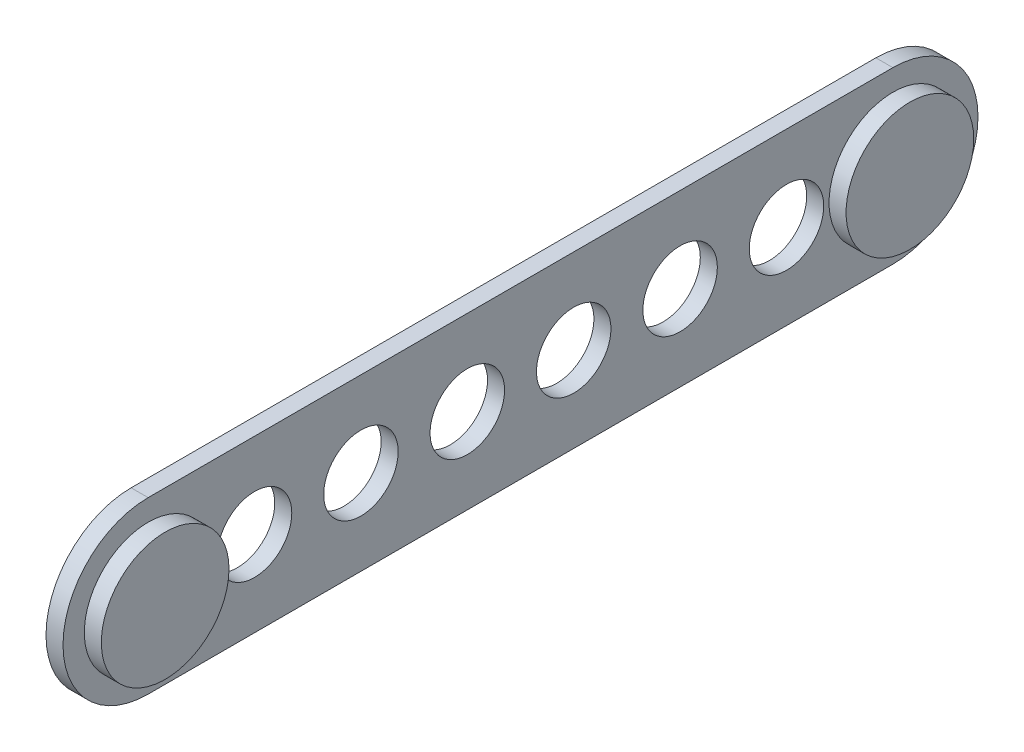
ISO-10303-21;
HEADER;
FILE_DESCRIPTION(('STEP AP214'),'2;1');
FILE_NAME('part.step','',(''),(''),'','','');
FILE_SCHEMA(('AUTOMOTIVE_DESIGN { 1 0 10303 214 1 1 1 1 }'));
ENDSEC;
DATA;
#1=APPLICATION_CONTEXT('core data for automotive mechanical design processes');
#2=APPLICATION_PROTOCOL_DEFINITION('international standard','automotive_design',2000,#1);
#3=PRODUCT_CONTEXT('',#1,'mechanical');
#4=PRODUCT('Part','Part','',(#3));
#5=PRODUCT_RELATED_PRODUCT_CATEGORY('part','',(#4));
#6=PRODUCT_DEFINITION_FORMATION('','',#4);
#7=PRODUCT_DEFINITION_CONTEXT('part definition',#1,'design');
#8=PRODUCT_DEFINITION('design','',#6,#7);
#9=PRODUCT_DEFINITION_SHAPE('','',#8);
#10=(LENGTH_UNIT() NAMED_UNIT(*) SI_UNIT(.MILLI.,.METRE.));
#11=(NAMED_UNIT(*) PLANE_ANGLE_UNIT() SI_UNIT($,.RADIAN.));
#12=(NAMED_UNIT(*) SI_UNIT($,.STERADIAN.) SOLID_ANGLE_UNIT());
#13=UNCERTAINTY_MEASURE_WITH_UNIT(LENGTH_MEASURE(1.E-05),#10,'distance_accuracy_value','');
#14=(GEOMETRIC_REPRESENTATION_CONTEXT(3) GLOBAL_UNCERTAINTY_ASSIGNED_CONTEXT((#13)) GLOBAL_UNIT_ASSIGNED_CONTEXT((#10,
#11,#12)) REPRESENTATION_CONTEXT('',''));
#15=CARTESIAN_POINT('',(0.,0.,0.));
#16=DIRECTION('',(0.,0.,1.));
#17=DIRECTION('',(1.,0.,0.));
#18=AXIS2_PLACEMENT_3D('',#15,#16,#17);
#19=CARTESIAN_POINT('',(4.064,0.,0.));
#20=DIRECTION('',(-1.,0.,0.));
#21=DIRECTION('',(0.,0.,1.));
#22=AXIS2_PLACEMENT_3D('',#19,#20,#21);
#23=CYLINDRICAL_SURFACE('',#22,20.32);
#24=CARTESIAN_POINT('',(0.,0.,0.));
#25=DIRECTION('',(1.,0.,0.));
#26=DIRECTION('',(0.,0.,-1.));
#27=AXIS2_PLACEMENT_3D('',#24,#25,#26);
#28=CIRCLE('',#27,20.32);
#29=CARTESIAN_POINT('',(0.,20.32,0.));
#30=VERTEX_POINT('',#29);
#31=CARTESIAN_POINT('',(0.,-20.32,0.));
#32=VERTEX_POINT('',#31);
#33=EDGE_CURVE('E102',#30,#32,#28,.T.);
#34=ORIENTED_EDGE('',*,*,#33,.T.);
#35=DIRECTION('',(-1.,0.,0.));
#36=VECTOR('',#35,1.);
#37=CARTESIAN_POINT('',(4.064,-20.32,0.));
#38=LINE('',#37,#36);
#39=CARTESIAN_POINT('',(4.064,-20.32,0.));
#40=VERTEX_POINT('',#39);
#41=EDGE_CURVE('E93',#40,#32,#38,.T.);
#42=ORIENTED_EDGE('',*,*,#41,.F.);
#43=CARTESIAN_POINT('',(4.064,0.,0.));
#44=DIRECTION('',(1.,0.,0.));
#45=DIRECTION('',(0.,0.,-1.));
#46=AXIS2_PLACEMENT_3D('',#43,#44,#45);
#47=CIRCLE('',#46,20.32);
#48=CARTESIAN_POINT('',(4.064,20.32,0.));
#49=VERTEX_POINT('',#48);
#50=EDGE_CURVE('E87',#49,#40,#47,.T.);
#51=ORIENTED_EDGE('',*,*,#50,.F.);
#52=DIRECTION('',(-1.,0.,0.));
#53=VECTOR('',#52,1.);
#54=CARTESIAN_POINT('',(4.064,20.32,0.));
#55=LINE('',#54,#53);
#56=EDGE_CURVE('E98',#49,#30,#55,.T.);
#57=ORIENTED_EDGE('',*,*,#56,.T.);
#58=EDGE_LOOP('',(#34,#42,#51,#57));
#59=FACE_BOUND('',#58,.T.);
#60=ADVANCED_FACE('F33',(#59),#23,.T.);
#61=CARTESIAN_POINT('',(4.064,-20.32,0.));
#62=DIRECTION('',(0.,1.,0.));
#63=DIRECTION('',(0.,0.,1.));
#64=AXIS2_PLACEMENT_3D('',#61,#62,#63);
#65=PLANE('',#64);
#66=DIRECTION('',(0.,0.,-1.));
#67=VECTOR('',#66,1.);
#68=CARTESIAN_POINT('',(0.,-20.32,0.));
#69=LINE('',#68,#67);
#70=CARTESIAN_POINT('',(0.,-20.32,-177.8));
#71=VERTEX_POINT('',#70);
#72=EDGE_CURVE('E92',#32,#71,#69,.T.);
#73=ORIENTED_EDGE('',*,*,#72,.T.);
#74=DIRECTION('',(-1.,0.,0.));
#75=VECTOR('',#74,1.);
#76=CARTESIAN_POINT('',(4.064,-20.32,-177.8));
#77=LINE('',#76,#75);
#78=CARTESIAN_POINT('',(4.064,-20.32,-177.8));
#79=VERTEX_POINT('',#78);
#80=EDGE_CURVE('E90',#79,#71,#77,.T.);
#81=ORIENTED_EDGE('',*,*,#80,.F.);
#82=DIRECTION('',(0.,0.,-1.));
#83=VECTOR('',#82,1.);
#84=CARTESIAN_POINT('',(4.064,-20.32,0.));
#85=LINE('',#84,#83);
#86=EDGE_CURVE('E81',#40,#79,#85,.T.);
#87=ORIENTED_EDGE('',*,*,#86,.F.);
#88=ORIENTED_EDGE('',*,*,#41,.T.);
#89=EDGE_LOOP('',(#73,#81,#87,#88));
#90=FACE_BOUND('',#89,.T.);
#91=ADVANCED_FACE('F91',(#90),#65,.F.);
#92=CARTESIAN_POINT('',(4.064,0.,-177.8));
#93=DIRECTION('',(-1.,0.,0.));
#94=DIRECTION('',(0.,0.,1.));
#95=AXIS2_PLACEMENT_3D('',#92,#93,#94);
#96=CYLINDRICAL_SURFACE('',#95,20.32);
#97=CARTESIAN_POINT('',(0.,0.,-177.8));
#98=DIRECTION('',(1.,0.,0.));
#99=DIRECTION('',(0.,0.,-1.));
#100=AXIS2_PLACEMENT_3D('',#97,#98,#99);
#101=CIRCLE('',#100,20.32);
#102=CARTESIAN_POINT('',(0.,20.32,-177.8));
#103=VERTEX_POINT('',#102);
#104=EDGE_CURVE('E67',#71,#103,#101,.T.);
#105=ORIENTED_EDGE('',*,*,#104,.T.);
#106=DIRECTION('',(-1.,0.,0.));
#107=VECTOR('',#106,1.);
#108=CARTESIAN_POINT('',(4.064,20.32,-177.8));
#109=LINE('',#108,#107);
#110=CARTESIAN_POINT('',(4.064,20.32,-177.8));
#111=VERTEX_POINT('',#110);
#112=EDGE_CURVE('E94',#111,#103,#109,.T.);
#113=ORIENTED_EDGE('',*,*,#112,.F.);
#114=CARTESIAN_POINT('',(4.064,0.,-177.8));
#115=DIRECTION('',(1.,0.,0.));
#116=DIRECTION('',(0.,0.,-1.));
#117=AXIS2_PLACEMENT_3D('',#114,#115,#116);
#118=CIRCLE('',#117,20.32);
#119=EDGE_CURVE('E85',#79,#111,#118,.T.);
#120=ORIENTED_EDGE('',*,*,#119,.F.);
#121=ORIENTED_EDGE('',*,*,#80,.T.);
#122=EDGE_LOOP('',(#105,#113,#120,#121));
#123=FACE_BOUND('',#122,.T.);
#124=ADVANCED_FACE('F96',(#123),#96,.T.);
#125=CARTESIAN_POINT('',(4.064,20.32,0.));
#126=DIRECTION('',(0.,-1.,0.));
#127=DIRECTION('',(0.,0.,-1.));
#128=AXIS2_PLACEMENT_3D('',#125,#126,#127);
#129=PLANE('',#128);
#130=DIRECTION('',(0.,0.,1.));
#131=VECTOR('',#130,1.);
#132=CARTESIAN_POINT('',(0.,20.32,0.));
#133=LINE('',#132,#131);
#134=EDGE_CURVE('E73',#103,#30,#133,.T.);
#135=ORIENTED_EDGE('',*,*,#134,.T.);
#136=ORIENTED_EDGE('',*,*,#56,.F.);
#137=DIRECTION('',(0.,0.,1.));
#138=VECTOR('',#137,1.);
#139=CARTESIAN_POINT('',(4.064,20.32,0.));
#140=LINE('',#139,#138);
#141=EDGE_CURVE('E50',#111,#49,#140,.T.);
#142=ORIENTED_EDGE('',*,*,#141,.F.);
#143=ORIENTED_EDGE('',*,*,#112,.T.);
#144=EDGE_LOOP('',(#135,#136,#142,#143));
#145=FACE_BOUND('',#144,.T.);
#146=ADVANCED_FACE('F140',(#145),#129,.F.);
#147=CARTESIAN_POINT('',(4.064,0.,0.));
#148=DIRECTION('',(1.,0.,0.));
#149=DIRECTION('',(0.,0.,-1.));
#150=AXIS2_PLACEMENT_3D('',#147,#148,#149);
#151=PLANE('',#150);
#152=CARTESIAN_POINT('',(4.064,0.,-50.8));
#153=DIRECTION('',(1.,0.,0.));
#154=DIRECTION('',(0.,0.,-1.));
#155=AXIS2_PLACEMENT_3D('',#152,#153,#154);
#156=CIRCLE('',#155,8.88999999999999);
#157=CARTESIAN_POINT('',(4.064,0.,-59.69));
#158=VERTEX_POINT('',#157);
#159=EDGE_CURVE('E312',#158,#158,#156,.T.);
#160=ORIENTED_EDGE('',*,*,#159,.F.);
#161=EDGE_LOOP('',(#160));
#162=FACE_BOUND('',#161,.T.);
#163=CARTESIAN_POINT('',(4.064,0.,-25.4));
#164=DIRECTION('',(1.,0.,0.));
#165=DIRECTION('',(0.,0.,-1.));
#166=AXIS2_PLACEMENT_3D('',#163,#164,#165);
#167=CIRCLE('',#166,8.88999999999999);
#168=CARTESIAN_POINT('',(4.064,0.,-34.29));
#169=VERTEX_POINT('',#168);
#170=EDGE_CURVE('E309',#169,#169,#167,.T.);
#171=ORIENTED_EDGE('',*,*,#170,.F.);
#172=EDGE_LOOP('',(#171));
#173=FACE_BOUND('',#172,.T.);
#174=CARTESIAN_POINT('',(4.064,0.,-177.8));
#175=DIRECTION('',(1.,0.,0.));
#176=DIRECTION('',(0.,0.,-1.));
#177=AXIS2_PLACEMENT_3D('',#174,#175,#176);
#178=CIRCLE('',#177,15.24);
#179=CARTESIAN_POINT('',(4.064,0.,-193.04));
#180=VERTEX_POINT('',#179);
#181=EDGE_CURVE('E303',#180,#180,#178,.T.);
#182=ORIENTED_EDGE('',*,*,#181,.F.);
#183=EDGE_LOOP('',(#182));
#184=FACE_BOUND('',#183,.T.);
#185=CARTESIAN_POINT('',(4.064,0.,0.));
#186=DIRECTION('',(1.,0.,0.));
#187=DIRECTION('',(0.,0.,-1.));
#188=AXIS2_PLACEMENT_3D('',#185,#186,#187);
#189=CIRCLE('',#188,15.24);
#190=CARTESIAN_POINT('',(4.064,0.,-15.24));
#191=VERTEX_POINT('',#190);
#192=EDGE_CURVE('E297',#191,#191,#189,.T.);
#193=ORIENTED_EDGE('',*,*,#192,.F.);
#194=EDGE_LOOP('',(#193));
#195=FACE_BOUND('',#194,.T.);
#196=ORIENTED_EDGE('',*,*,#50,.T.);
#197=ORIENTED_EDGE('',*,*,#86,.T.);
#198=ORIENTED_EDGE('',*,*,#119,.T.);
#199=ORIENTED_EDGE('',*,*,#141,.T.);
#200=EDGE_LOOP('',(#196,#197,#198,#199));
#201=FACE_BOUND('',#200,.T.);
#202=CARTESIAN_POINT('',(4.064,0.,-76.2));
#203=DIRECTION('',(1.,0.,0.));
#204=DIRECTION('',(0.,0.,-1.));
#205=AXIS2_PLACEMENT_3D('',#202,#203,#204);
#206=CIRCLE('',#205,8.88999999999999);
#207=CARTESIAN_POINT('',(4.064,0.,-85.09));
#208=VERTEX_POINT('',#207);
#209=EDGE_CURVE('E115',#208,#208,#206,.T.);
#210=ORIENTED_EDGE('',*,*,#209,.F.);
#211=EDGE_LOOP('',(#210));
#212=FACE_BOUND('',#211,.T.);
#213=CARTESIAN_POINT('',(4.064,0.,-101.6));
#214=DIRECTION('',(1.,0.,0.));
#215=DIRECTION('',(0.,0.,-1.));
#216=AXIS2_PLACEMENT_3D('',#213,#214,#215);
#217=CIRCLE('',#216,8.88999999999999);
#218=CARTESIAN_POINT('',(4.064,0.,-110.49));
#219=VERTEX_POINT('',#218);
#220=EDGE_CURVE('E121',#219,#219,#217,.T.);
#221=ORIENTED_EDGE('',*,*,#220,.F.);
#222=EDGE_LOOP('',(#221));
#223=FACE_BOUND('',#222,.T.);
#224=CARTESIAN_POINT('',(4.064,0.,-127.));
#225=DIRECTION('',(1.,0.,0.));
#226=DIRECTION('',(0.,0.,-1.));
#227=AXIS2_PLACEMENT_3D('',#224,#225,#226);
#228=CIRCLE('',#227,8.88999999999999);
#229=CARTESIAN_POINT('',(4.064,0.,-135.89));
#230=VERTEX_POINT('',#229);
#231=EDGE_CURVE('E127',#230,#230,#228,.T.);
#232=ORIENTED_EDGE('',*,*,#231,.F.);
#233=EDGE_LOOP('',(#232));
#234=FACE_BOUND('',#233,.T.);
#235=CARTESIAN_POINT('',(4.064,0.,-152.4));
#236=DIRECTION('',(1.,0.,0.));
#237=DIRECTION('',(0.,0.,-1.));
#238=AXIS2_PLACEMENT_3D('',#235,#236,#237);
#239=CIRCLE('',#238,8.88999999999999);
#240=CARTESIAN_POINT('',(4.064,0.,-161.29));
#241=VERTEX_POINT('',#240);
#242=EDGE_CURVE('E11',#241,#241,#239,.T.);
#243=ORIENTED_EDGE('',*,*,#242,.F.);
#244=EDGE_LOOP('',(#243));
#245=FACE_BOUND('',#244,.T.);
#246=ADVANCED_FACE('F82',(#162,#173,#184,#195,#201,#212,#223,#234,#245),#151,.T.);
#247=CARTESIAN_POINT('',(0.,0.,0.));
#248=DIRECTION('',(1.,0.,0.));
#249=DIRECTION('',(0.,0.,-1.));
#250=AXIS2_PLACEMENT_3D('',#247,#248,#249);
#251=PLANE('',#250);
#252=CARTESIAN_POINT('',(0.,0.,-50.8));
#253=DIRECTION('',(1.,0.,0.));
#254=DIRECTION('',(0.,0.,-1.));
#255=AXIS2_PLACEMENT_3D('',#252,#253,#254);
#256=CIRCLE('',#255,8.88999999999999);
#257=CARTESIAN_POINT('',(0.,0.,-59.69));
#258=VERTEX_POINT('',#257);
#259=EDGE_CURVE('E317',#258,#258,#256,.T.);
#260=ORIENTED_EDGE('',*,*,#259,.T.);
#261=EDGE_LOOP('',(#260));
#262=FACE_BOUND('',#261,.T.);
#263=CARTESIAN_POINT('',(0.,0.,-25.4));
#264=DIRECTION('',(1.,0.,0.));
#265=DIRECTION('',(0.,0.,-1.));
#266=AXIS2_PLACEMENT_3D('',#263,#264,#265);
#267=CIRCLE('',#266,8.88999999999999);
#268=CARTESIAN_POINT('',(0.,0.,-34.29));
#269=VERTEX_POINT('',#268);
#270=EDGE_CURVE('E307',#269,#269,#267,.T.);
#271=ORIENTED_EDGE('',*,*,#270,.T.);
#272=EDGE_LOOP('',(#271));
#273=FACE_BOUND('',#272,.T.);
#274=ORIENTED_EDGE('',*,*,#33,.F.);
#275=ORIENTED_EDGE('',*,*,#134,.F.);
#276=ORIENTED_EDGE('',*,*,#104,.F.);
#277=ORIENTED_EDGE('',*,*,#72,.F.);
#278=EDGE_LOOP('',(#274,#275,#276,#277));
#279=FACE_BOUND('',#278,.T.);
#280=CARTESIAN_POINT('',(0.,0.,-76.2));
#281=DIRECTION('',(1.,0.,0.));
#282=DIRECTION('',(0.,0.,-1.));
#283=AXIS2_PLACEMENT_3D('',#280,#281,#282);
#284=CIRCLE('',#283,8.88999999999999);
#285=CARTESIAN_POINT('',(0.,0.,-85.09));
#286=VERTEX_POINT('',#285);
#287=EDGE_CURVE('E112',#286,#286,#284,.T.);
#288=ORIENTED_EDGE('',*,*,#287,.T.);
#289=EDGE_LOOP('',(#288));
#290=FACE_BOUND('',#289,.T.);
#291=CARTESIAN_POINT('',(0.,0.,-101.6));
#292=DIRECTION('',(1.,0.,0.));
#293=DIRECTION('',(0.,0.,-1.));
#294=AXIS2_PLACEMENT_3D('',#291,#292,#293);
#295=CIRCLE('',#294,8.88999999999999);
#296=CARTESIAN_POINT('',(0.,0.,-110.49));
#297=VERTEX_POINT('',#296);
#298=EDGE_CURVE('E118',#297,#297,#295,.T.);
#299=ORIENTED_EDGE('',*,*,#298,.T.);
#300=EDGE_LOOP('',(#299));
#301=FACE_BOUND('',#300,.T.);
#302=CARTESIAN_POINT('',(0.,0.,-127.));
#303=DIRECTION('',(1.,0.,0.));
#304=DIRECTION('',(0.,0.,-1.));
#305=AXIS2_PLACEMENT_3D('',#302,#303,#304);
#306=CIRCLE('',#305,8.88999999999999);
#307=CARTESIAN_POINT('',(0.,0.,-135.89));
#308=VERTEX_POINT('',#307);
#309=EDGE_CURVE('E124',#308,#308,#306,.T.);
#310=ORIENTED_EDGE('',*,*,#309,.T.);
#311=EDGE_LOOP('',(#310));
#312=FACE_BOUND('',#311,.T.);
#313=CARTESIAN_POINT('',(0.,0.,-152.4));
#314=DIRECTION('',(1.,0.,0.));
#315=DIRECTION('',(0.,0.,-1.));
#316=AXIS2_PLACEMENT_3D('',#313,#314,#315);
#317=CIRCLE('',#316,8.88999999999999);
#318=CARTESIAN_POINT('',(0.,0.,-161.29));
#319=VERTEX_POINT('',#318);
#320=EDGE_CURVE('E42',#319,#319,#317,.T.);
#321=ORIENTED_EDGE('',*,*,#320,.T.);
#322=EDGE_LOOP('',(#321));
#323=FACE_BOUND('',#322,.T.);
#324=ADVANCED_FACE('F132',(#262,#273,#279,#290,#301,#312,#323),#251,.F.);
#325=CARTESIAN_POINT('',(8.128,0.,0.));
#326=DIRECTION('',(-1.,0.,0.));
#327=DIRECTION('',(0.,0.,1.));
#328=AXIS2_PLACEMENT_3D('',#325,#326,#327);
#329=CYLINDRICAL_SURFACE('',#328,15.24);
#330=CARTESIAN_POINT('',(8.128,0.,0.));
#331=DIRECTION('',(1.,0.,0.));
#332=DIRECTION('',(0.,0.,-1.));
#333=AXIS2_PLACEMENT_3D('',#330,#331,#332);
#334=CIRCLE('',#333,15.24);
#335=CARTESIAN_POINT('',(8.128,0.,-15.24));
#336=VERTEX_POINT('',#335);
#337=EDGE_CURVE('E105',#336,#336,#334,.T.);
#338=ORIENTED_EDGE('',*,*,#337,.F.);
#339=EDGE_LOOP('',(#338));
#340=FACE_BOUND('',#339,.T.);
#341=ORIENTED_EDGE('',*,*,#192,.T.);
#342=EDGE_LOOP('',(#341));
#343=FACE_BOUND('',#342,.T.);
#344=ADVANCED_FACE('F147',(#340,#343),#329,.T.);
#345=CARTESIAN_POINT('',(8.128,0.,0.));
#346=DIRECTION('',(1.,0.,0.));
#347=DIRECTION('',(0.,0.,-1.));
#348=AXIS2_PLACEMENT_3D('',#345,#346,#347);
#349=PLANE('',#348);
#350=ORIENTED_EDGE('',*,*,#337,.T.);
#351=EDGE_LOOP('',(#350));
#352=FACE_BOUND('',#351,.T.);
#353=ADVANCED_FACE('F235',(#352),#349,.T.);
#354=CARTESIAN_POINT('',(8.128,0.,-177.8));
#355=DIRECTION('',(-1.,0.,0.));
#356=DIRECTION('',(0.,0.,1.));
#357=AXIS2_PLACEMENT_3D('',#354,#355,#356);
#358=CYLINDRICAL_SURFACE('',#357,15.24);
#359=CARTESIAN_POINT('',(8.128,0.,-177.8));
#360=DIRECTION('',(1.,0.,0.));
#361=DIRECTION('',(0.,0.,-1.));
#362=AXIS2_PLACEMENT_3D('',#359,#360,#361);
#363=CIRCLE('',#362,15.24);
#364=CARTESIAN_POINT('',(8.128,0.,-193.04));
#365=VERTEX_POINT('',#364);
#366=EDGE_CURVE('E299',#365,#365,#363,.T.);
#367=ORIENTED_EDGE('',*,*,#366,.F.);
#368=EDGE_LOOP('',(#367));
#369=FACE_BOUND('',#368,.T.);
#370=ORIENTED_EDGE('',*,*,#181,.T.);
#371=EDGE_LOOP('',(#370));
#372=FACE_BOUND('',#371,.T.);
#373=ADVANCED_FACE('F226',(#369,#372),#358,.T.);
#374=CARTESIAN_POINT('',(8.128,0.,-177.8));
#375=DIRECTION('',(1.,0.,0.));
#376=DIRECTION('',(0.,0.,-1.));
#377=AXIS2_PLACEMENT_3D('',#374,#375,#376);
#378=PLANE('',#377);
#379=ORIENTED_EDGE('',*,*,#366,.T.);
#380=EDGE_LOOP('',(#379));
#381=FACE_BOUND('',#380,.T.);
#382=ADVANCED_FACE('F217',(#381),#378,.T.);
#383=CARTESIAN_POINT('',(0.,0.,-25.4));
#384=DIRECTION('',(1.,0.,0.));
#385=DIRECTION('',(0.,0.,-1.));
#386=AXIS2_PLACEMENT_3D('',#383,#384,#385);
#387=CYLINDRICAL_SURFACE('',#386,8.88999999999999);
#388=ORIENTED_EDGE('',*,*,#270,.F.);
#389=EDGE_LOOP('',(#388));
#390=FACE_BOUND('',#389,.T.);
#391=ORIENTED_EDGE('',*,*,#170,.T.);
#392=EDGE_LOOP('',(#391));
#393=FACE_BOUND('',#392,.T.);
#394=ADVANCED_FACE('F207',(#390,#393),#387,.F.);
#395=CARTESIAN_POINT('',(0.,0.,-50.8));
#396=DIRECTION('',(1.,0.,0.));
#397=DIRECTION('',(0.,0.,-1.));
#398=AXIS2_PLACEMENT_3D('',#395,#396,#397);
#399=CYLINDRICAL_SURFACE('',#398,8.88999999999999);
#400=ORIENTED_EDGE('',*,*,#259,.F.);
#401=EDGE_LOOP('',(#400));
#402=FACE_BOUND('',#401,.T.);
#403=ORIENTED_EDGE('',*,*,#159,.T.);
#404=EDGE_LOOP('',(#403));
#405=FACE_BOUND('',#404,.T.);
#406=ADVANCED_FACE('F167',(#402,#405),#399,.F.);
#407=CARTESIAN_POINT('',(0.,0.,-76.2));
#408=DIRECTION('',(1.,0.,0.));
#409=DIRECTION('',(0.,0.,-1.));
#410=AXIS2_PLACEMENT_3D('',#407,#408,#409);
#411=CYLINDRICAL_SURFACE('',#410,8.88999999999999);
#412=ORIENTED_EDGE('',*,*,#287,.F.);
#413=EDGE_LOOP('',(#412));
#414=FACE_BOUND('',#413,.T.);
#415=ORIENTED_EDGE('',*,*,#209,.T.);
#416=EDGE_LOOP('',(#415));
#417=FACE_BOUND('',#416,.T.);
#418=ADVANCED_FACE('F163',(#414,#417),#411,.F.);
#419=CARTESIAN_POINT('',(0.,0.,-101.6));
#420=DIRECTION('',(1.,0.,0.));
#421=DIRECTION('',(0.,0.,-1.));
#422=AXIS2_PLACEMENT_3D('',#419,#420,#421);
#423=CYLINDRICAL_SURFACE('',#422,8.88999999999999);
#424=ORIENTED_EDGE('',*,*,#298,.F.);
#425=EDGE_LOOP('',(#424));
#426=FACE_BOUND('',#425,.T.);
#427=ORIENTED_EDGE('',*,*,#220,.T.);
#428=EDGE_LOOP('',(#427));
#429=FACE_BOUND('',#428,.T.);
#430=ADVANCED_FACE('F166',(#426,#429),#423,.F.);
#431=CARTESIAN_POINT('',(0.,0.,-127.));
#432=DIRECTION('',(1.,0.,0.));
#433=DIRECTION('',(0.,0.,-1.));
#434=AXIS2_PLACEMENT_3D('',#431,#432,#433);
#435=CYLINDRICAL_SURFACE('',#434,8.88999999999999);
#436=ORIENTED_EDGE('',*,*,#309,.F.);
#437=EDGE_LOOP('',(#436));
#438=FACE_BOUND('',#437,.T.);
#439=ORIENTED_EDGE('',*,*,#231,.T.);
#440=EDGE_LOOP('',(#439));
#441=FACE_BOUND('',#440,.T.);
#442=ADVANCED_FACE('F136',(#438,#441),#435,.F.);
#443=CARTESIAN_POINT('',(0.,0.,-152.4));
#444=DIRECTION('',(1.,0.,0.));
#445=DIRECTION('',(0.,0.,-1.));
#446=AXIS2_PLACEMENT_3D('',#443,#444,#445);
#447=CYLINDRICAL_SURFACE('',#446,8.88999999999999);
#448=ORIENTED_EDGE('',*,*,#320,.F.);
#449=EDGE_LOOP('',(#448));
#450=FACE_BOUND('',#449,.T.);
#451=ORIENTED_EDGE('',*,*,#242,.T.);
#452=EDGE_LOOP('',(#451));
#453=FACE_BOUND('',#452,.T.);
#454=ADVANCED_FACE('F35',(#450,#453),#447,.F.);
#455=CLOSED_SHELL('',(#60,#91,#124,#146,#246,#324,#344,#353,#373,#382,#394,#406,#418,#430,#442,#454));
#456=MANIFOLD_SOLID_BREP('B2',#455);
#457=ADVANCED_BREP_SHAPE_REPRESENTATION('',(#18,#456),#14);
#458=SHAPE_DEFINITION_REPRESENTATION(#9,#457);
ENDSEC;
END-ISO-10303-21;
